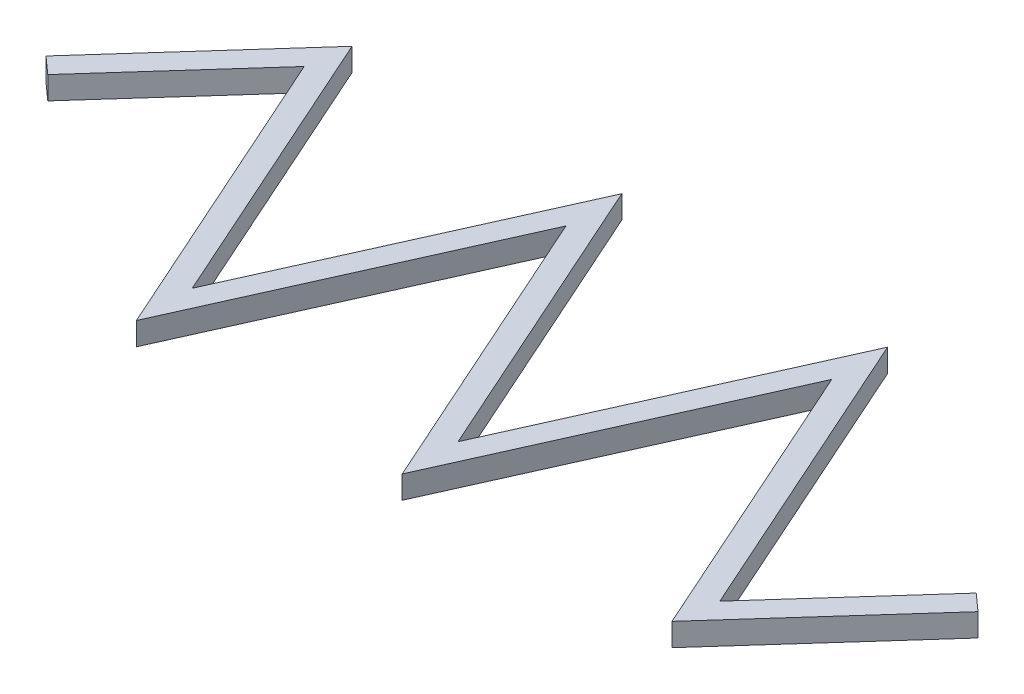
ISO-10303-21;
HEADER;
FILE_DESCRIPTION(('STEP AP214'),'2;1');
FILE_NAME('part.step','',(''),(''),'','','');
FILE_SCHEMA(('AUTOMOTIVE_DESIGN { 1 0 10303 214 1 1 1 1 }'));
ENDSEC;
DATA;
#1=APPLICATION_CONTEXT('core data for automotive mechanical design processes');
#2=APPLICATION_PROTOCOL_DEFINITION('international standard','automotive_design',2000,#1);
#3=PRODUCT_CONTEXT('',#1,'mechanical');
#4=PRODUCT('Part','Part','',(#3));
#5=PRODUCT_RELATED_PRODUCT_CATEGORY('part','',(#4));
#6=PRODUCT_DEFINITION_FORMATION('','',#4);
#7=PRODUCT_DEFINITION_CONTEXT('part definition',#1,'design');
#8=PRODUCT_DEFINITION('design','',#6,#7);
#9=PRODUCT_DEFINITION_SHAPE('','',#8);
#10=(LENGTH_UNIT() NAMED_UNIT(*) SI_UNIT(.MILLI.,.METRE.));
#11=(NAMED_UNIT(*) PLANE_ANGLE_UNIT() SI_UNIT($,.RADIAN.));
#12=(NAMED_UNIT(*) SI_UNIT($,.STERADIAN.) SOLID_ANGLE_UNIT());
#13=UNCERTAINTY_MEASURE_WITH_UNIT(LENGTH_MEASURE(1.E-05),#10,'distance_accuracy_value','');
#14=(GEOMETRIC_REPRESENTATION_CONTEXT(3) GLOBAL_UNCERTAINTY_ASSIGNED_CONTEXT((#13)) GLOBAL_UNIT_ASSIGNED_CONTEXT((#10,
#11,#12)) REPRESENTATION_CONTEXT('',''));
#15=CARTESIAN_POINT('',(0.,0.,0.));
#16=DIRECTION('',(0.,0.,1.));
#17=DIRECTION('',(1.,0.,0.));
#18=AXIS2_PLACEMENT_3D('',#15,#16,#17);
#19=CARTESIAN_POINT('',(-5.18623206792405,2.,5.78861001454241));
#20=DIRECTION('',(0.667291310767897,0.,-0.744796822343961));
#21=DIRECTION('',(-0.744796822343961,0.,-0.667291310767897));
#22=AXIS2_PLACEMENT_3D('',#19,#20,#21);
#23=PLANE('',#22);
#24=DIRECTION('',(0.744796822343961,0.,0.667291310767897));
#25=VECTOR('',#24,1.);
#26=CARTESIAN_POINT('',(-5.18623206792405,0.,5.78861001454241));
#27=LINE('',#26,#25);
#28=CARTESIAN_POINT('',(-12.3919827121577,0.,-0.667291310767898));
#29=VERTEX_POINT('',#28);
#30=CARTESIAN_POINT('',(-10.9023890674698,0.,0.667291310767898));
#31=VERTEX_POINT('',#30);
#32=EDGE_CURVE('E176',#29,#31,#27,.T.);
#33=ORIENTED_EDGE('',*,*,#32,.F.);
#34=DIRECTION('',(0.,-1.,0.));
#35=VECTOR('',#34,1.);
#36=CARTESIAN_POINT('',(-12.3919827121577,2.,-0.667291310767898));
#37=LINE('',#36,#35);
#38=CARTESIAN_POINT('',(-12.3919827121577,2.,-0.667291310767898));
#39=VERTEX_POINT('',#38);
#40=EDGE_CURVE('E11',#39,#29,#37,.T.);
#41=ORIENTED_EDGE('',*,*,#40,.F.);
#42=DIRECTION('',(0.744796822343961,0.,0.667291310767897));
#43=VECTOR('',#42,1.);
#44=CARTESIAN_POINT('',(-5.18623206792405,2.,5.78861001454241));
#45=LINE('',#44,#43);
#46=CARTESIAN_POINT('',(-10.9023890674698,2.,0.667291310767898));
#47=VERTEX_POINT('',#46);
#48=EDGE_CURVE('E214',#39,#47,#45,.T.);
#49=ORIENTED_EDGE('',*,*,#48,.T.);
#50=DIRECTION('',(0.,-1.,0.));
#51=VECTOR('',#50,1.);
#52=CARTESIAN_POINT('',(-10.9023890674698,2.,0.667291310767898));
#53=LINE('',#52,#51);
#54=EDGE_CURVE('E111',#47,#31,#53,.T.);
#55=ORIENTED_EDGE('',*,*,#54,.T.);
#56=EDGE_LOOP('',(#33,#41,#49,#55));
#57=FACE_BOUND('',#56,.T.);
#58=ADVANCED_FACE('F36',(#57),#23,.T.);
#59=CARTESIAN_POINT('',(-7.20575064423363,2.,-6.45590132531031));
#60=DIRECTION('',(-0.744796822343961,0.,-0.667291310767898));
#61=DIRECTION('',(-0.667291310767898,0.,0.744796822343961));
#62=AXIS2_PLACEMENT_3D('',#59,#60,#61);
#63=PLANE('',#62);
#64=DIRECTION('',(0.667291310767898,0.,-0.744796822343961));
#65=VECTOR('',#64,1.);
#66=CARTESIAN_POINT('',(-7.20575064423363,0.,-6.45590132531031));
#67=LINE('',#66,#65);
#68=CARTESIAN_POINT('',(-23.0114187310591,0.,11.1855862471025));
#69=VERTEX_POINT('',#68);
#70=EDGE_CURVE('E179',#69,#29,#67,.T.);
#71=ORIENTED_EDGE('',*,*,#70,.F.);
#72=DIRECTION('',(0.,-1.,0.));
#73=VECTOR('',#72,1.);
#74=CARTESIAN_POINT('',(-23.0114187310591,2.,11.1855862471025));
#75=LINE('',#74,#73);
#76=CARTESIAN_POINT('',(-23.0114187310591,2.,11.1855862471025));
#77=VERTEX_POINT('',#76);
#78=EDGE_CURVE('E44',#77,#69,#75,.T.);
#79=ORIENTED_EDGE('',*,*,#78,.F.);
#80=DIRECTION('',(0.667291310767898,0.,-0.744796822343961));
#81=VECTOR('',#80,1.);
#82=CARTESIAN_POINT('',(-7.20575064423363,2.,-6.45590132531031));
#83=LINE('',#82,#81);
#84=EDGE_CURVE('E263',#77,#39,#83,.T.);
#85=ORIENTED_EDGE('',*,*,#84,.T.);
#86=ORIENTED_EDGE('',*,*,#40,.T.);
#87=EDGE_LOOP('',(#71,#79,#85,#86));
#88=FACE_BOUND('',#87,.T.);
#89=ADVANCED_FACE('F251',(#88),#63,.T.);
#90=CARTESIAN_POINT('',(-23.3386962008361,2.,10.4550051183472));
#91=DIRECTION('',(0.912613933163747,0.,-0.408822466353546));
#92=DIRECTION('',(-0.408822466353546,0.,-0.912613933163747));
#93=AXIS2_PLACEMENT_3D('',#90,#91,#92);
#94=PLANE('',#93);
#95=DIRECTION('',(0.408822466353546,0.,0.912613933163747));
#96=VECTOR('',#95,1.);
#97=CARTESIAN_POINT('',(-23.3386962008361,0.,10.4550051183472));
#98=LINE('',#97,#96);
#99=CARTESIAN_POINT('',(-34.9415576694412,0.,-15.4460495258967));
#100=VERTEX_POINT('',#99);
#101=EDGE_CURVE('E182',#100,#69,#98,.T.);
#102=ORIENTED_EDGE('',*,*,#101,.F.);
#103=DIRECTION('',(0.,-1.,0.));
#104=VECTOR('',#103,1.);
#105=CARTESIAN_POINT('',(-34.9415576694412,2.,-15.4460495258967));
#106=LINE('',#105,#104);
#107=CARTESIAN_POINT('',(-34.9415576694412,2.,-15.4460495258967));
#108=VERTEX_POINT('',#107);
#109=EDGE_CURVE('E240',#108,#100,#106,.T.);
#110=ORIENTED_EDGE('',*,*,#109,.F.);
#111=DIRECTION('',(0.408822466353546,0.,0.912613933163747));
#112=VECTOR('',#111,1.);
#113=CARTESIAN_POINT('',(-23.3386962008361,2.,10.4550051183472));
#114=LINE('',#113,#112);
#115=EDGE_CURVE('E247',#108,#77,#114,.T.);
#116=ORIENTED_EDGE('',*,*,#115,.T.);
#117=ORIENTED_EDGE('',*,*,#78,.T.);
#118=EDGE_LOOP('',(#102,#110,#116,#117));
#119=FACE_BOUND('',#118,.T.);
#120=ADVANCED_FACE('F245',(#119),#94,.T.);
#121=CARTESIAN_POINT('',(-34.8644481207635,2.,-15.6181810849346));
#122=DIRECTION('',(-0.912613933163747,0.,-0.408822466353546));
#123=DIRECTION('',(-0.408822466353546,0.,0.912613933163747));
#124=AXIS2_PLACEMENT_3D('',#121,#122,#123);
#125=PLANE('',#124);
#126=DIRECTION('',(0.408822466353546,0.,-0.912613933163747));
#127=VECTOR('',#126,1.);
#128=CARTESIAN_POINT('',(-34.8644481207635,0.,-15.6181810849346));
#129=LINE('',#128,#127);
#130=CARTESIAN_POINT('',(-46.5887435592549,0.,10.5539504741033));
#131=VERTEX_POINT('',#130);
#132=EDGE_CURVE('E185',#131,#100,#129,.T.);
#133=ORIENTED_EDGE('',*,*,#132,.F.);
#134=DIRECTION('',(0.,-1.,0.));
#135=VECTOR('',#134,1.);
#136=CARTESIAN_POINT('',(-46.5887435592549,2.,10.5539504741033));
#137=LINE('',#136,#135);
#138=CARTESIAN_POINT('',(-46.5887435592549,2.,10.5539504741033));
#139=VERTEX_POINT('',#138);
#140=EDGE_CURVE('E238',#139,#131,#137,.T.);
#141=ORIENTED_EDGE('',*,*,#140,.F.);
#142=DIRECTION('',(0.408822466353546,0.,-0.912613933163747));
#143=VECTOR('',#142,1.);
#144=CARTESIAN_POINT('',(-34.8644481207635,2.,-15.6181810849346));
#145=LINE('',#144,#143);
#146=EDGE_CURVE('E260',#139,#108,#145,.T.);
#147=ORIENTED_EDGE('',*,*,#146,.T.);
#148=ORIENTED_EDGE('',*,*,#109,.T.);
#149=EDGE_LOOP('',(#133,#141,#147,#148));
#150=FACE_BOUND('',#149,.T.);
#151=ADVANCED_FACE('F257',(#150),#125,.T.);
#152=CARTESIAN_POINT('',(-42.739744308036,2.,19.1460671861078));
#153=DIRECTION('',(0.912613933163747,0.,-0.408822466353546));
#154=DIRECTION('',(-0.408822466353546,0.,-0.912613933163747));
#155=AXIS2_PLACEMENT_3D('',#152,#153,#154);
#156=PLANE('',#155);
#157=DIRECTION('',(0.408822466353546,0.,0.912613933163747));
#158=VECTOR('',#157,1.);
#159=CARTESIAN_POINT('',(-42.739744308036,0.,19.1460671861078));
#160=LINE('',#159,#158);
#161=CARTESIAN_POINT('',(-58.2359294490686,0.,-15.4460495258967));
#162=VERTEX_POINT('',#161);
#163=EDGE_CURVE('E188',#162,#131,#160,.T.);
#164=ORIENTED_EDGE('',*,*,#163,.F.);
#165=DIRECTION('',(0.,-1.,0.));
#166=VECTOR('',#165,1.);
#167=CARTESIAN_POINT('',(-58.2359294490686,2.,-15.4460495258967));
#168=LINE('',#167,#166);
#169=CARTESIAN_POINT('',(-58.2359294490686,2.,-15.4460495258967));
#170=VERTEX_POINT('',#169);
#171=EDGE_CURVE('E236',#170,#162,#168,.T.);
#172=ORIENTED_EDGE('',*,*,#171,.F.);
#173=DIRECTION('',(0.408822466353546,0.,0.912613933163747));
#174=VECTOR('',#173,1.);
#175=CARTESIAN_POINT('',(-42.739744308036,2.,19.1460671861078));
#176=LINE('',#175,#174);
#177=EDGE_CURVE('E265',#170,#139,#176,.T.);
#178=ORIENTED_EDGE('',*,*,#177,.T.);
#179=ORIENTED_EDGE('',*,*,#140,.T.);
#180=EDGE_LOOP('',(#164,#172,#178,#179));
#181=FACE_BOUND('',#180,.T.);
#182=ADVANCED_FACE('F311',(#181),#156,.T.);
#183=CARTESIAN_POINT('',(-54.2654962279634,2.,-24.3092431526952));
#184=DIRECTION('',(-0.912613933163747,0.,-0.408822466353546));
#185=DIRECTION('',(-0.408822466353546,0.,0.912613933163747));
#186=AXIS2_PLACEMENT_3D('',#183,#184,#185);
#187=PLANE('',#186);
#188=DIRECTION('',(0.408822466353546,0.,-0.912613933163747));
#189=VECTOR('',#188,1.);
#190=CARTESIAN_POINT('',(-54.2654962279634,0.,-24.3092431526952));
#191=LINE('',#190,#189);
#192=CARTESIAN_POINT('',(-69.8831153388823,0.,10.5539504741033));
#193=VERTEX_POINT('',#192);
#194=EDGE_CURVE('E191',#193,#162,#191,.T.);
#195=ORIENTED_EDGE('',*,*,#194,.F.);
#196=DIRECTION('',(0.,-1.,0.));
#197=VECTOR('',#196,1.);
#198=CARTESIAN_POINT('',(-69.8831153388823,2.,10.5539504741033));
#199=LINE('',#198,#197);
#200=CARTESIAN_POINT('',(-69.8831153388823,2.,10.5539504741033));
#201=VERTEX_POINT('',#200);
#202=EDGE_CURVE('E234',#201,#193,#199,.T.);
#203=ORIENTED_EDGE('',*,*,#202,.F.);
#204=DIRECTION('',(0.408822466353546,0.,-0.912613933163747));
#205=VECTOR('',#204,1.);
#206=CARTESIAN_POINT('',(-54.2654962279634,2.,-24.3092431526952));
#207=LINE('',#206,#205);
#208=EDGE_CURVE('E271',#201,#170,#207,.T.);
#209=ORIENTED_EDGE('',*,*,#208,.T.);
#210=ORIENTED_EDGE('',*,*,#171,.T.);
#211=EDGE_LOOP('',(#195,#203,#209,#210));
#212=FACE_BOUND('',#211,.T.);
#213=ADVANCED_FACE('F314',(#212),#187,.T.);
#214=CARTESIAN_POINT('',(-62.1407924152359,2.,27.8371292538684));
#215=DIRECTION('',(0.912613933163747,0.,-0.408822466353546));
#216=DIRECTION('',(-0.408822466353546,0.,-0.912613933163747));
#217=AXIS2_PLACEMENT_3D('',#214,#215,#216);
#218=PLANE('',#217);
#219=DIRECTION('',(0.408822466353546,0.,0.912613933163747));
#220=VECTOR('',#219,1.);
#221=CARTESIAN_POINT('',(-62.1407924152359,0.,27.8371292538684));
#222=LINE('',#221,#220);
#223=CARTESIAN_POINT('',(-81.2473481801277,0.,-14.8144137528975));
#224=VERTEX_POINT('',#223);
#225=EDGE_CURVE('E194',#224,#193,#222,.T.);
#226=ORIENTED_EDGE('',*,*,#225,.F.);
#227=DIRECTION('',(0.,-1.,0.));
#228=VECTOR('',#227,1.);
#229=CARTESIAN_POINT('',(-81.2473481801277,2.,-14.8144137528975));
#230=LINE('',#229,#228);
#231=CARTESIAN_POINT('',(-81.2473481801277,2.,-14.8144137528975));
#232=VERTEX_POINT('',#231);
#233=EDGE_CURVE('E232',#232,#224,#230,.T.);
#234=ORIENTED_EDGE('',*,*,#233,.F.);
#235=DIRECTION('',(0.408822466353546,0.,0.912613933163747));
#236=VECTOR('',#235,1.);
#237=CARTESIAN_POINT('',(-62.1407924152359,2.,27.8371292538684));
#238=LINE('',#237,#236);
#239=EDGE_CURVE('E274',#232,#201,#238,.T.);
#240=ORIENTED_EDGE('',*,*,#239,.T.);
#241=ORIENTED_EDGE('',*,*,#202,.T.);
#242=EDGE_LOOP('',(#226,#234,#240,#241));
#243=FACE_BOUND('',#242,.T.);
#244=ADVANCED_FACE('F318',(#243),#218,.T.);
#245=CARTESIAN_POINT('',(-52.4324273974613,2.,-46.9761714271072));
#246=DIRECTION('',(-0.744796822343961,0.,-0.667291310767897));
#247=DIRECTION('',(-0.667291310767897,0.,0.744796822343961));
#248=AXIS2_PLACEMENT_3D('',#245,#246,#247);
#249=PLANE('',#248);
#250=DIRECTION('',(0.667291310767897,0.,-0.744796822343961));
#251=VECTOR('',#250,1.);
#252=CARTESIAN_POINT('',(-52.4324273974613,0.,-46.9761714271072));
#253=LINE('',#252,#251);
#254=CARTESIAN_POINT('',(-93.9222839408537,0.,-0.667291310767898));
#255=VERTEX_POINT('',#254);
#256=EDGE_CURVE('E197',#255,#224,#253,.T.);
#257=ORIENTED_EDGE('',*,*,#256,.F.);
#258=DIRECTION('',(0.,-1.,0.));
#259=VECTOR('',#258,1.);
#260=CARTESIAN_POINT('',(-93.9222839408537,2.,-0.667291310767898));
#261=LINE('',#260,#259);
#262=CARTESIAN_POINT('',(-93.9222839408537,2.,-0.667291310767898));
#263=VERTEX_POINT('',#262);
#264=EDGE_CURVE('E230',#263,#255,#261,.T.);
#265=ORIENTED_EDGE('',*,*,#264,.F.);
#266=DIRECTION('',(0.667291310767897,0.,-0.744796822343961));
#267=VECTOR('',#266,1.);
#268=CARTESIAN_POINT('',(-52.4324273974613,2.,-46.9761714271072));
#269=LINE('',#268,#267);
#270=EDGE_CURVE('E277',#263,#232,#269,.T.);
#271=ORIENTED_EDGE('',*,*,#270,.T.);
#272=ORIENTED_EDGE('',*,*,#233,.T.);
#273=EDGE_LOOP('',(#257,#265,#271,#272));
#274=FACE_BOUND('',#273,.T.);
#275=ADVANCED_FACE('F322',(#274),#249,.T.);
#276=CARTESIAN_POINT('',(-41.4898565433923,2.,46.3088801163392));
#277=DIRECTION('',(0.667291310767896,0.,-0.744796822343961));
#278=DIRECTION('',(-0.744796822343961,0.,-0.667291310767896));
#279=AXIS2_PLACEMENT_3D('',#276,#277,#278);
#280=PLANE('',#279);
#281=DIRECTION('',(0.744796822343961,0.,0.667291310767896));
#282=VECTOR('',#281,1.);
#283=CARTESIAN_POINT('',(-41.4898565433923,0.,46.3088801163392));
#284=LINE('',#283,#282);
#285=CARTESIAN_POINT('',(-92.4326902961658,0.,0.667291310767898));
#286=VERTEX_POINT('',#285);
#287=EDGE_CURVE('E200',#255,#286,#284,.T.);
#288=ORIENTED_EDGE('',*,*,#287,.T.);
#289=DIRECTION('',(0.,-1.,0.));
#290=VECTOR('',#289,1.);
#291=CARTESIAN_POINT('',(-92.4326902961658,2.,0.667291310767898));
#292=LINE('',#291,#290);
#293=CARTESIAN_POINT('',(-92.4326902961658,2.,0.667291310767898));
#294=VERTEX_POINT('',#293);
#295=EDGE_CURVE('E227',#294,#286,#292,.T.);
#296=ORIENTED_EDGE('',*,*,#295,.F.);
#297=DIRECTION('',(0.744796822343961,0.,0.667291310767896));
#298=VECTOR('',#297,1.);
#299=CARTESIAN_POINT('',(-41.4898565433923,2.,46.3088801163392));
#300=LINE('',#299,#298);
#301=EDGE_CURVE('E280',#263,#294,#300,.T.);
#302=ORIENTED_EDGE('',*,*,#301,.F.);
#303=ORIENTED_EDGE('',*,*,#264,.T.);
#304=EDGE_LOOP('',(#288,#296,#302,#303));
#305=FACE_BOUND('',#304,.T.);
#306=ADVANCED_FACE('F326',(#305),#280,.F.);
#307=CARTESIAN_POINT('',(-50.9428337527734,2.,-45.6415888055714));
#308=DIRECTION('',(-0.744796822343961,0.,-0.667291310767898));
#309=DIRECTION('',(-0.667291310767898,0.,0.744796822343961));
#310=AXIS2_PLACEMENT_3D('',#307,#308,#309);
#311=PLANE('',#310);
#312=DIRECTION('',(0.667291310767898,0.,-0.744796822343961));
#313=VECTOR('',#312,1.);
#314=CARTESIAN_POINT('',(-50.9428337527734,0.,-45.6415888055714));
#315=LINE('',#314,#313);
#316=CARTESIAN_POINT('',(-81.8132542772644,0.,-11.1855862471025));
#317=VERTEX_POINT('',#316);
#318=EDGE_CURVE('E202',#286,#317,#315,.T.);
#319=ORIENTED_EDGE('',*,*,#318,.T.);
#320=DIRECTION('',(0.,-1.,0.));
#321=VECTOR('',#320,1.);
#322=CARTESIAN_POINT('',(-81.8132542772644,2.,-11.1855862471025));
#323=LINE('',#322,#321);
#324=CARTESIAN_POINT('',(-81.8132542772644,2.,-11.1855862471025));
#325=VERTEX_POINT('',#324);
#326=EDGE_CURVE('E224',#325,#317,#323,.T.);
#327=ORIENTED_EDGE('',*,*,#326,.F.);
#328=DIRECTION('',(0.667291310767898,0.,-0.744796822343961));
#329=VECTOR('',#328,1.);
#330=CARTESIAN_POINT('',(-50.9428337527734,2.,-45.6415888055714));
#331=LINE('',#330,#329);
#332=EDGE_CURVE('E282',#294,#325,#331,.T.);
#333=ORIENTED_EDGE('',*,*,#332,.F.);
#334=ORIENTED_EDGE('',*,*,#295,.T.);
#335=EDGE_LOOP('',(#319,#327,#333,#334));
#336=FACE_BOUND('',#335,.T.);
#337=ADVANCED_FACE('F330',(#336),#311,.F.);
#338=CARTESIAN_POINT('',(-63.9660202815634,2.,28.6547741865755));
#339=DIRECTION('',(0.912613933163747,0.,-0.408822466353546));
#340=DIRECTION('',(-0.408822466353546,0.,-0.912613933163747));
#341=AXIS2_PLACEMENT_3D('',#338,#339,#340);
#342=PLANE('',#341);
#343=DIRECTION('',(0.408822466353546,0.,0.912613933163747));
#344=VECTOR('',#343,1.);
#345=CARTESIAN_POINT('',(-63.9660202815634,0.,28.6547741865755));
#346=LINE('',#345,#344);
#347=CARTESIAN_POINT('',(-69.8831153388823,0.,15.4460495258967));
#348=VERTEX_POINT('',#347);
#349=EDGE_CURVE('E204',#317,#348,#346,.T.);
#350=ORIENTED_EDGE('',*,*,#349,.T.);
#351=DIRECTION('',(0.,-1.,0.));
#352=VECTOR('',#351,1.);
#353=CARTESIAN_POINT('',(-69.8831153388823,2.,15.4460495258967));
#354=LINE('',#353,#352);
#355=CARTESIAN_POINT('',(-69.8831153388823,2.,15.4460495258967));
#356=VERTEX_POINT('',#355);
#357=EDGE_CURVE('E221',#356,#348,#354,.T.);
#358=ORIENTED_EDGE('',*,*,#357,.F.);
#359=DIRECTION('',(0.408822466353546,0.,0.912613933163747));
#360=VECTOR('',#359,1.);
#361=CARTESIAN_POINT('',(-63.9660202815634,2.,28.6547741865755));
#362=LINE('',#361,#360);
#363=EDGE_CURVE('E284',#325,#356,#362,.T.);
#364=ORIENTED_EDGE('',*,*,#363,.F.);
#365=ORIENTED_EDGE('',*,*,#326,.T.);
#366=EDGE_LOOP('',(#350,#358,#364,#365));
#367=FACE_BOUND('',#366,.T.);
#368=ADVANCED_FACE('F334',(#367),#342,.F.);
#369=CARTESIAN_POINT('',(-52.4402683616359,2.,-23.4915982199881));
#370=DIRECTION('',(-0.912613933163747,0.,-0.408822466353546));
#371=DIRECTION('',(-0.408822466353546,0.,0.912613933163747));
#372=AXIS2_PLACEMENT_3D('',#369,#370,#371);
#373=PLANE('',#372);
#374=DIRECTION('',(0.408822466353546,0.,-0.912613933163747));
#375=VECTOR('',#374,1.);
#376=CARTESIAN_POINT('',(-52.4402683616359,0.,-23.4915982199881));
#377=LINE('',#376,#375);
#378=CARTESIAN_POINT('',(-58.2359294490686,0.,-10.5539504741033));
#379=VERTEX_POINT('',#378);
#380=EDGE_CURVE('E206',#348,#379,#377,.T.);
#381=ORIENTED_EDGE('',*,*,#380,.T.);
#382=DIRECTION('',(0.,-1.,0.));
#383=VECTOR('',#382,1.);
#384=CARTESIAN_POINT('',(-58.2359294490686,2.,-10.5539504741033));
#385=LINE('',#384,#383);
#386=CARTESIAN_POINT('',(-58.2359294490686,2.,-10.5539504741033));
#387=VERTEX_POINT('',#386);
#388=EDGE_CURVE('E218',#387,#379,#385,.T.);
#389=ORIENTED_EDGE('',*,*,#388,.F.);
#390=DIRECTION('',(0.408822466353546,0.,-0.912613933163747));
#391=VECTOR('',#390,1.);
#392=CARTESIAN_POINT('',(-52.4402683616359,2.,-23.4915982199881));
#393=LINE('',#392,#391);
#394=EDGE_CURVE('E286',#356,#387,#393,.T.);
#395=ORIENTED_EDGE('',*,*,#394,.F.);
#396=ORIENTED_EDGE('',*,*,#357,.T.);
#397=EDGE_LOOP('',(#381,#389,#395,#396));
#398=FACE_BOUND('',#397,.T.);
#399=ADVANCED_FACE('F292',(#398),#373,.F.);
#400=CARTESIAN_POINT('',(-44.5649721743635,2.,19.9637121188149));
#401=DIRECTION('',(0.912613933163747,0.,-0.408822466353546));
#402=DIRECTION('',(-0.408822466353546,0.,-0.912613933163747));
#403=AXIS2_PLACEMENT_3D('',#400,#401,#402);
#404=PLANE('',#403);
#405=DIRECTION('',(0.408822466353546,0.,0.912613933163747));
#406=VECTOR('',#405,1.);
#407=CARTESIAN_POINT('',(-44.5649721743635,0.,19.9637121188149));
#408=LINE('',#407,#406);
#409=CARTESIAN_POINT('',(-46.5887435592549,0.,15.4460495258967));
#410=VERTEX_POINT('',#409);
#411=EDGE_CURVE('E208',#379,#410,#408,.T.);
#412=ORIENTED_EDGE('',*,*,#411,.T.);
#413=DIRECTION('',(0.,-1.,0.));
#414=VECTOR('',#413,1.);
#415=CARTESIAN_POINT('',(-46.5887435592549,2.,15.4460495258967));
#416=LINE('',#415,#414);
#417=CARTESIAN_POINT('',(-46.5887435592549,2.,15.4460495258967));
#418=VERTEX_POINT('',#417);
#419=EDGE_CURVE('E168',#418,#410,#416,.T.);
#420=ORIENTED_EDGE('',*,*,#419,.F.);
#421=DIRECTION('',(0.408822466353546,0.,0.912613933163747));
#422=VECTOR('',#421,1.);
#423=CARTESIAN_POINT('',(-44.5649721743635,2.,19.9637121188149));
#424=LINE('',#423,#422);
#425=EDGE_CURVE('E159',#387,#418,#424,.T.);
#426=ORIENTED_EDGE('',*,*,#425,.F.);
#427=ORIENTED_EDGE('',*,*,#388,.T.);
#428=EDGE_LOOP('',(#412,#420,#426,#427));
#429=FACE_BOUND('',#428,.T.);
#430=ADVANCED_FACE('F296',(#429),#404,.F.);
#431=CARTESIAN_POINT('',(-33.039220254436,2.,-14.8005361522275));
#432=DIRECTION('',(-0.912613933163747,0.,-0.408822466353546));
#433=DIRECTION('',(-0.408822466353546,0.,0.912613933163747));
#434=AXIS2_PLACEMENT_3D('',#431,#432,#433);
#435=PLANE('',#434);
#436=DIRECTION('',(0.408822466353546,0.,-0.912613933163747));
#437=VECTOR('',#436,1.);
#438=CARTESIAN_POINT('',(-33.039220254436,0.,-14.8005361522275));
#439=LINE('',#438,#437);
#440=CARTESIAN_POINT('',(-34.9415576694411,0.,-10.5539504741033));
#441=VERTEX_POINT('',#440);
#442=EDGE_CURVE('E167',#410,#441,#439,.T.);
#443=ORIENTED_EDGE('',*,*,#442,.T.);
#444=DIRECTION('',(0.,-1.,0.));
#445=VECTOR('',#444,1.);
#446=CARTESIAN_POINT('',(-34.9415576694411,2.,-10.5539504741033));
#447=LINE('',#446,#445);
#448=CARTESIAN_POINT('',(-34.9415576694411,2.,-10.5539504741033));
#449=VERTEX_POINT('',#448);
#450=EDGE_CURVE('E164',#449,#441,#447,.T.);
#451=ORIENTED_EDGE('',*,*,#450,.F.);
#452=DIRECTION('',(0.408822466353546,0.,-0.912613933163747));
#453=VECTOR('',#452,1.);
#454=CARTESIAN_POINT('',(-33.039220254436,2.,-14.8005361522275));
#455=LINE('',#454,#453);
#456=EDGE_CURVE('E153',#418,#449,#455,.T.);
#457=ORIENTED_EDGE('',*,*,#456,.F.);
#458=ORIENTED_EDGE('',*,*,#419,.T.);
#459=EDGE_LOOP('',(#443,#451,#457,#458));
#460=FACE_BOUND('',#459,.T.);
#461=ADVANCED_FACE('F165',(#460),#435,.F.);
#462=CARTESIAN_POINT('',(-25.1639240671636,2.,11.2726500510543));
#463=DIRECTION('',(0.912613933163747,0.,-0.408822466353546));
#464=DIRECTION('',(-0.408822466353546,0.,-0.912613933163747));
#465=AXIS2_PLACEMENT_3D('',#462,#463,#464);
#466=PLANE('',#465);
#467=DIRECTION('',(0.408822466353546,0.,0.912613933163747));
#468=VECTOR('',#467,1.);
#469=CARTESIAN_POINT('',(-25.1639240671636,0.,11.2726500510543));
#470=LINE('',#469,#468);
#471=CARTESIAN_POINT('',(-23.5773248281958,0.,14.8144137528975));
#472=VERTEX_POINT('',#471);
#473=EDGE_CURVE('E104',#441,#472,#470,.T.);
#474=ORIENTED_EDGE('',*,*,#473,.T.);
#475=DIRECTION('',(0.,-1.,0.));
#476=VECTOR('',#475,1.);
#477=CARTESIAN_POINT('',(-23.5773248281958,2.,14.8144137528975));
#478=LINE('',#477,#476);
#479=CARTESIAN_POINT('',(-23.5773248281958,2.,14.8144137528975));
#480=VERTEX_POINT('',#479);
#481=EDGE_CURVE('E169',#480,#472,#478,.T.);
#482=ORIENTED_EDGE('',*,*,#481,.F.);
#483=DIRECTION('',(0.408822466353546,0.,0.912613933163747));
#484=VECTOR('',#483,1.);
#485=CARTESIAN_POINT('',(-25.1639240671636,2.,11.2726500510543));
#486=LINE('',#485,#484);
#487=EDGE_CURVE('E157',#449,#480,#486,.T.);
#488=ORIENTED_EDGE('',*,*,#487,.F.);
#489=ORIENTED_EDGE('',*,*,#450,.T.);
#490=EDGE_LOOP('',(#474,#482,#488,#489));
#491=FACE_BOUND('',#490,.T.);
#492=ADVANCED_FACE('F171',(#491),#466,.F.);
#493=CARTESIAN_POINT('',(-5.7161569995457,2.,-5.12131870377451));
#494=DIRECTION('',(-0.74479682234396,0.,-0.667291310767898));
#495=DIRECTION('',(-0.667291310767898,0.,0.74479682234396));
#496=AXIS2_PLACEMENT_3D('',#493,#494,#495);
#497=PLANE('',#496);
#498=DIRECTION('',(0.667291310767898,0.,-0.74479682234396));
#499=VECTOR('',#498,1.);
#500=CARTESIAN_POINT('',(-5.7161569995457,0.,-5.12131870377451));
#501=LINE('',#500,#499);
#502=EDGE_CURVE('E212',#472,#31,#501,.T.);
#503=ORIENTED_EDGE('',*,*,#502,.T.);
#504=ORIENTED_EDGE('',*,*,#54,.F.);
#505=DIRECTION('',(0.667291310767898,0.,-0.74479682234396));
#506=VECTOR('',#505,1.);
#507=CARTESIAN_POINT('',(-5.7161569995457,2.,-5.12131870377451));
#508=LINE('',#507,#506);
#509=EDGE_CURVE('E52',#480,#47,#508,.T.);
#510=ORIENTED_EDGE('',*,*,#509,.F.);
#511=ORIENTED_EDGE('',*,*,#481,.T.);
#512=EDGE_LOOP('',(#503,#504,#510,#511));
#513=FACE_BOUND('',#512,.T.);
#514=ADVANCED_FACE('F299',(#513),#497,.F.);
#515=CARTESIAN_POINT('',(0.,2.,0.));
#516=DIRECTION('',(0.,1.,0.));
#517=DIRECTION('',(0.,0.,1.));
#518=AXIS2_PLACEMENT_3D('',#515,#516,#517);
#519=PLANE('',#518);
#520=ORIENTED_EDGE('',*,*,#48,.F.);
#521=ORIENTED_EDGE('',*,*,#84,.F.);
#522=ORIENTED_EDGE('',*,*,#115,.F.);
#523=ORIENTED_EDGE('',*,*,#146,.F.);
#524=ORIENTED_EDGE('',*,*,#177,.F.);
#525=ORIENTED_EDGE('',*,*,#208,.F.);
#526=ORIENTED_EDGE('',*,*,#239,.F.);
#527=ORIENTED_EDGE('',*,*,#270,.F.);
#528=ORIENTED_EDGE('',*,*,#301,.T.);
#529=ORIENTED_EDGE('',*,*,#332,.T.);
#530=ORIENTED_EDGE('',*,*,#363,.T.);
#531=ORIENTED_EDGE('',*,*,#394,.T.);
#532=ORIENTED_EDGE('',*,*,#425,.T.);
#533=ORIENTED_EDGE('',*,*,#456,.T.);
#534=ORIENTED_EDGE('',*,*,#487,.T.);
#535=ORIENTED_EDGE('',*,*,#509,.T.);
#536=EDGE_LOOP('',(#520,#521,#522,#523,#524,#525,#526,#527,#528,#529,#530,#531,#532,#533,#534,#535));
#537=FACE_BOUND('',#536,.T.);
#538=ADVANCED_FACE('F155',(#537),#519,.T.);
#539=CARTESIAN_POINT('',(0.,0.,0.));
#540=DIRECTION('',(0.,1.,0.));
#541=DIRECTION('',(0.,0.,1.));
#542=AXIS2_PLACEMENT_3D('',#539,#540,#541);
#543=PLANE('',#542);
#544=ORIENTED_EDGE('',*,*,#32,.T.);
#545=ORIENTED_EDGE('',*,*,#502,.F.);
#546=ORIENTED_EDGE('',*,*,#473,.F.);
#547=ORIENTED_EDGE('',*,*,#442,.F.);
#548=ORIENTED_EDGE('',*,*,#411,.F.);
#549=ORIENTED_EDGE('',*,*,#380,.F.);
#550=ORIENTED_EDGE('',*,*,#349,.F.);
#551=ORIENTED_EDGE('',*,*,#318,.F.);
#552=ORIENTED_EDGE('',*,*,#287,.F.);
#553=ORIENTED_EDGE('',*,*,#256,.T.);
#554=ORIENTED_EDGE('',*,*,#225,.T.);
#555=ORIENTED_EDGE('',*,*,#194,.T.);
#556=ORIENTED_EDGE('',*,*,#163,.T.);
#557=ORIENTED_EDGE('',*,*,#132,.T.);
#558=ORIENTED_EDGE('',*,*,#101,.T.);
#559=ORIENTED_EDGE('',*,*,#70,.T.);
#560=EDGE_LOOP('',(#544,#545,#546,#547,#548,#549,#550,#551,#552,#553,#554,#555,#556,#557,#558,#559));
#561=FACE_BOUND('',#560,.T.);
#562=ADVANCED_FACE('F253',(#561),#543,.F.);
#563=CLOSED_SHELL('',(#58,#89,#120,#151,#182,#213,#244,#275,#306,#337,#368,#399,#430,#461,#492,
#514,#538,#562));
#564=MANIFOLD_SOLID_BREP('B2',#563);
#565=ADVANCED_BREP_SHAPE_REPRESENTATION('',(#18,#564),#14);
#566=SHAPE_DEFINITION_REPRESENTATION(#9,#565);
ENDSEC;
END-ISO-10303-21;
